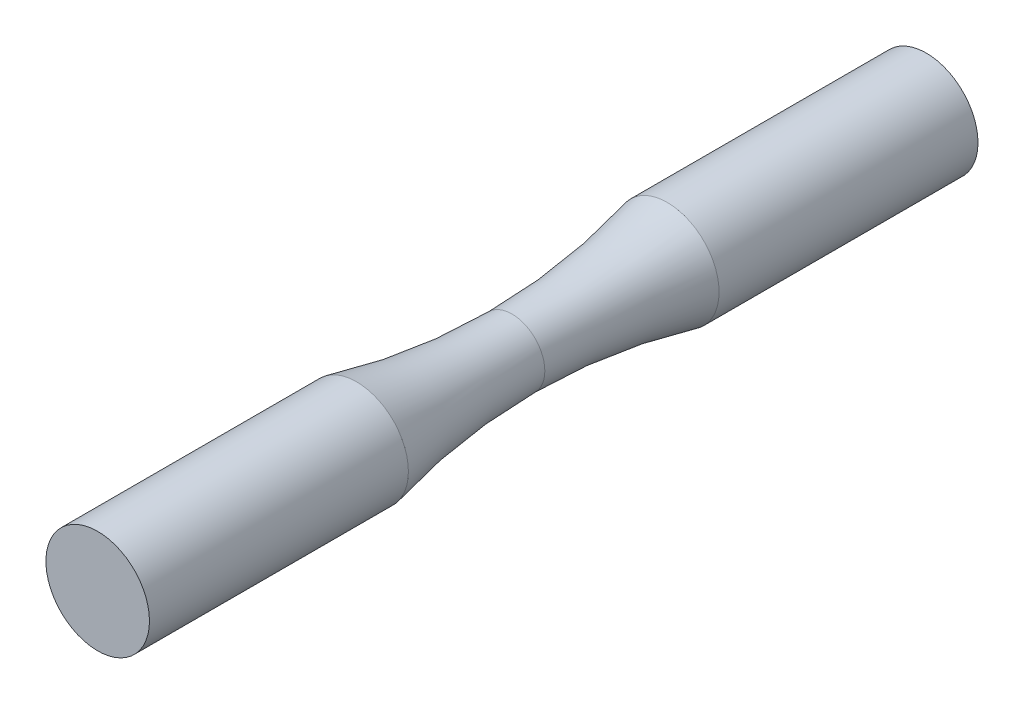
ISO-10303-21;
HEADER;
FILE_DESCRIPTION(('STEP AP214'),'2;1');
FILE_NAME('part.step','',(''),(''),'','','');
FILE_SCHEMA(('AUTOMOTIVE_DESIGN { 1 0 10303 214 1 1 1 1 }'));
ENDSEC;
DATA;
#1=APPLICATION_CONTEXT('core data for automotive mechanical design processes');
#2=APPLICATION_PROTOCOL_DEFINITION('international standard','automotive_design',2000,#1);
#3=PRODUCT_CONTEXT('',#1,'mechanical');
#4=PRODUCT('Part','Part','',(#3));
#5=PRODUCT_RELATED_PRODUCT_CATEGORY('part','',(#4));
#6=PRODUCT_DEFINITION_FORMATION('','',#4);
#7=PRODUCT_DEFINITION_CONTEXT('part definition',#1,'design');
#8=PRODUCT_DEFINITION('design','',#6,#7);
#9=PRODUCT_DEFINITION_SHAPE('','',#8);
#10=(LENGTH_UNIT() NAMED_UNIT(*) SI_UNIT(.MILLI.,.METRE.));
#11=(NAMED_UNIT(*) PLANE_ANGLE_UNIT() SI_UNIT($,.RADIAN.));
#12=(NAMED_UNIT(*) SI_UNIT($,.STERADIAN.) SOLID_ANGLE_UNIT());
#13=UNCERTAINTY_MEASURE_WITH_UNIT(LENGTH_MEASURE(1.E-05),#10,'distance_accuracy_value','');
#14=(GEOMETRIC_REPRESENTATION_CONTEXT(3) GLOBAL_UNCERTAINTY_ASSIGNED_CONTEXT((#13)) GLOBAL_UNIT_ASSIGNED_CONTEXT((#10,
#11,#12)) REPRESENTATION_CONTEXT('',''));
#15=CARTESIAN_POINT('',(0.,0.,0.));
#16=DIRECTION('',(0.,0.,1.));
#17=DIRECTION('',(1.,0.,0.));
#18=AXIS2_PLACEMENT_3D('',#15,#16,#17);
#19=CARTESIAN_POINT('',(0.,0.,50.8));
#20=DIRECTION('',(0.,0.,-1.));
#21=DIRECTION('',(-1.,0.,0.));
#22=AXIS2_PLACEMENT_3D('',#19,#20,#21);
#23=TOROIDAL_SURFACE('',#22,83.4787962328767,79.4465462328767);
#24=CARTESIAN_POINT('',(0.,0.,31.75));
#25=DIRECTION('',(0.,0.,1.));
#26=DIRECTION('',(1.,0.,0.));
#27=AXIS2_PLACEMENT_3D('',#24,#25,#26);
#28=CIRCLE('',#27,6.35);
#29=CARTESIAN_POINT('',(6.35,0.,31.75));
#30=VERTEX_POINT('',#29);
#31=EDGE_CURVE('E44',#30,#30,#28,.T.);
#32=ORIENTED_EDGE('',*,*,#31,.T.);
#33=EDGE_LOOP('',(#32));
#34=FACE_BOUND('',#33,.T.);
#35=CARTESIAN_POINT('',(0.,0.,50.8));
#36=DIRECTION('',(0.,0.,-1.));
#37=DIRECTION('',(1.,0.,0.));
#38=AXIS2_PLACEMENT_3D('',#35,#36,#37);
#39=CIRCLE('',#38,4.03224999999999);
#40=CARTESIAN_POINT('',(4.03224999999999,0.,50.8));
#41=VERTEX_POINT('',#40);
#42=EDGE_CURVE('E11',#41,#41,#39,.T.);
#43=ORIENTED_EDGE('',*,*,#42,.T.);
#44=EDGE_LOOP('',(#43));
#45=FACE_BOUND('',#44,.T.);
#46=ADVANCED_FACE('F37',(#34,#45),#23,.F.);
#47=CARTESIAN_POINT('',(0.,0.,31.75));
#48=DIRECTION('',(0.,0.,-1.));
#49=DIRECTION('',(-1.,0.,0.));
#50=AXIS2_PLACEMENT_3D('',#47,#48,#49);
#51=CYLINDRICAL_SURFACE('',#50,6.35);
#52=ORIENTED_EDGE('',*,*,#31,.F.);
#53=EDGE_LOOP('',(#52));
#54=FACE_BOUND('',#53,.T.);
#55=CARTESIAN_POINT('',(0.,0.,0.));
#56=DIRECTION('',(0.,0.,1.));
#57=DIRECTION('',(1.,0.,0.));
#58=AXIS2_PLACEMENT_3D('',#55,#56,#57);
#59=CIRCLE('',#58,6.35);
#60=CARTESIAN_POINT('',(6.35,0.,0.));
#61=VERTEX_POINT('',#60);
#62=EDGE_CURVE('E48',#61,#61,#59,.T.);
#63=ORIENTED_EDGE('',*,*,#62,.T.);
#64=EDGE_LOOP('',(#63));
#65=FACE_BOUND('',#64,.T.);
#66=ADVANCED_FACE('F39',(#54,#65),#51,.T.);
#67=CARTESIAN_POINT('',(0.,0.,0.));
#68=DIRECTION('',(0.,0.,1.));
#69=DIRECTION('',(1.,0.,0.));
#70=AXIS2_PLACEMENT_3D('',#67,#68,#69);
#71=PLANE('',#70);
#72=ORIENTED_EDGE('',*,*,#62,.F.);
#73=EDGE_LOOP('',(#72));
#74=FACE_BOUND('',#73,.T.);
#75=ADVANCED_FACE('F71',(#74),#71,.F.);
#76=ORIENTED_EDGE('',*,*,#42,.F.);
#77=EDGE_LOOP('',(#76));
#78=FACE_BOUND('',#77,.T.);
#79=CARTESIAN_POINT('',(0.,0.,69.85));
#80=DIRECTION('',(0.,0.,1.));
#81=DIRECTION('',(1.,0.,0.));
#82=AXIS2_PLACEMENT_3D('',#79,#80,#81);
#83=CIRCLE('',#82,6.34999999999999);
#84=CARTESIAN_POINT('',(6.34999999999999,0.,69.85));
#85=VERTEX_POINT('',#84);
#86=EDGE_CURVE('E55',#85,#85,#83,.T.);
#87=ORIENTED_EDGE('',*,*,#86,.F.);
#88=EDGE_LOOP('',(#87));
#89=FACE_BOUND('',#88,.T.);
#90=ADVANCED_FACE('F66',(#78,#89),#23,.F.);
#91=CARTESIAN_POINT('',(0.,0.,101.6));
#92=DIRECTION('',(0.,0.,-1.));
#93=DIRECTION('',(-1.,0.,0.));
#94=AXIS2_PLACEMENT_3D('',#91,#92,#93);
#95=CYLINDRICAL_SURFACE('',#94,6.34999999999999);
#96=CARTESIAN_POINT('',(0.,0.,101.6));
#97=DIRECTION('',(0.,0.,1.));
#98=DIRECTION('',(1.,0.,0.));
#99=AXIS2_PLACEMENT_3D('',#96,#97,#98);
#100=CIRCLE('',#99,6.34999999999999);
#101=CARTESIAN_POINT('',(6.34999999999999,0.,101.6));
#102=VERTEX_POINT('',#101);
#103=EDGE_CURVE('E53',#102,#102,#100,.T.);
#104=ORIENTED_EDGE('',*,*,#103,.F.);
#105=EDGE_LOOP('',(#104));
#106=FACE_BOUND('',#105,.T.);
#107=ORIENTED_EDGE('',*,*,#86,.T.);
#108=EDGE_LOOP('',(#107));
#109=FACE_BOUND('',#108,.T.);
#110=ADVANCED_FACE('F63',(#106,#109),#95,.T.);
#111=CARTESIAN_POINT('',(0.,0.,101.6));
#112=DIRECTION('',(0.,0.,1.));
#113=DIRECTION('',(1.,0.,0.));
#114=AXIS2_PLACEMENT_3D('',#111,#112,#113);
#115=PLANE('',#114);
#116=ORIENTED_EDGE('',*,*,#103,.T.);
#117=EDGE_LOOP('',(#116));
#118=FACE_BOUND('',#117,.T.);
#119=ADVANCED_FACE('F61',(#118),#115,.T.);
#120=CLOSED_SHELL('',(#46,#66,#75,#90,#110,#119));
#121=MANIFOLD_SOLID_BREP('B2',#120);
#122=ADVANCED_BREP_SHAPE_REPRESENTATION('',(#18,#121),#14);
#123=SHAPE_DEFINITION_REPRESENTATION(#9,#122);
ENDSEC;
END-ISO-10303-21;
